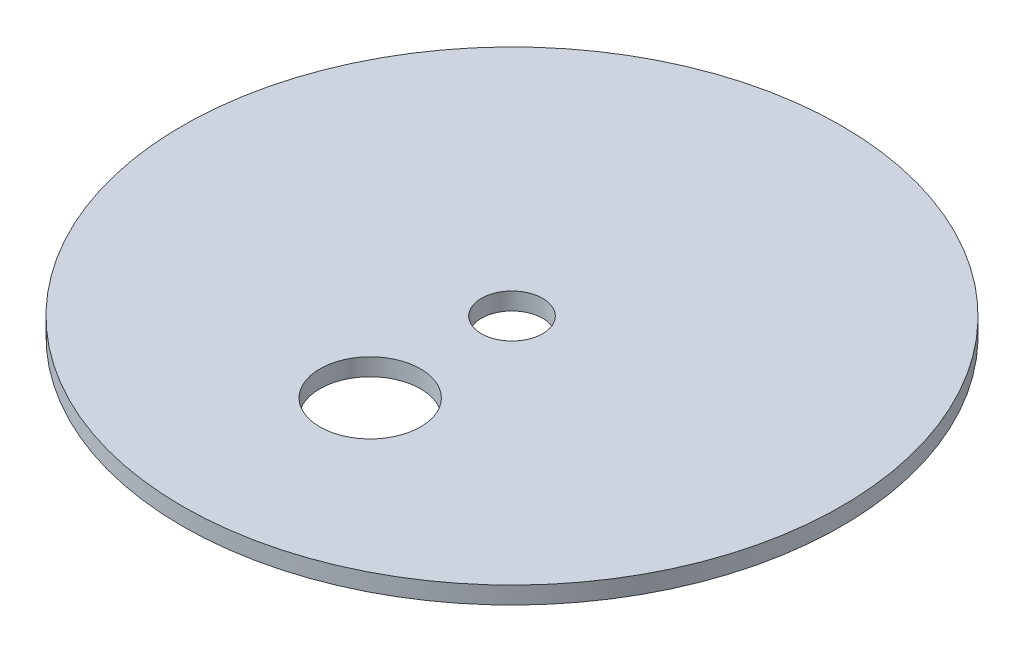
ISO-10303-21;
HEADER;
FILE_DESCRIPTION(('STEP AP214'),'2;1');
FILE_NAME('part.step','',(''),(''),'','','');
FILE_SCHEMA(('AUTOMOTIVE_DESIGN { 1 0 10303 214 1 1 1 1 }'));
ENDSEC;
DATA;
#1=APPLICATION_CONTEXT('core data for automotive mechanical design processes');
#2=APPLICATION_PROTOCOL_DEFINITION('international standard','automotive_design',2000,#1);
#3=PRODUCT_CONTEXT('',#1,'mechanical');
#4=PRODUCT('Part','Part','',(#3));
#5=PRODUCT_RELATED_PRODUCT_CATEGORY('part','',(#4));
#6=PRODUCT_DEFINITION_FORMATION('','',#4);
#7=PRODUCT_DEFINITION_CONTEXT('part definition',#1,'design');
#8=PRODUCT_DEFINITION('design','',#6,#7);
#9=PRODUCT_DEFINITION_SHAPE('','',#8);
#10=(LENGTH_UNIT() NAMED_UNIT(*) SI_UNIT(.MILLI.,.METRE.));
#11=(NAMED_UNIT(*) PLANE_ANGLE_UNIT() SI_UNIT($,.RADIAN.));
#12=(NAMED_UNIT(*) SI_UNIT($,.STERADIAN.) SOLID_ANGLE_UNIT());
#13=UNCERTAINTY_MEASURE_WITH_UNIT(LENGTH_MEASURE(1.E-05),#10,'distance_accuracy_value','');
#14=(GEOMETRIC_REPRESENTATION_CONTEXT(3) GLOBAL_UNCERTAINTY_ASSIGNED_CONTEXT((#13)) GLOBAL_UNIT_ASSIGNED_CONTEXT((#10,
#11,#12)) REPRESENTATION_CONTEXT('',''));
#15=CARTESIAN_POINT('',(0.,0.,0.));
#16=DIRECTION('',(0.,0.,1.));
#17=DIRECTION('',(1.,0.,0.));
#18=AXIS2_PLACEMENT_3D('',#15,#16,#17);
#19=CARTESIAN_POINT('',(0.,3.,0.));
#20=DIRECTION('',(0.,-1.,0.));
#21=DIRECTION('',(0.,0.,-1.));
#22=AXIS2_PLACEMENT_3D('',#19,#20,#21);
#23=CYLINDRICAL_SURFACE('',#22,57.15);
#24=CARTESIAN_POINT('',(0.,3.,0.));
#25=DIRECTION('',(0.,1.,0.));
#26=DIRECTION('',(0.,0.,1.));
#27=AXIS2_PLACEMENT_3D('',#24,#25,#26);
#28=CIRCLE('',#27,57.15);
#29=CARTESIAN_POINT('',(0.,3.,57.15));
#30=VERTEX_POINT('',#29);
#31=EDGE_CURVE('E10',#30,#30,#28,.T.);
#32=ORIENTED_EDGE('',*,*,#31,.F.);
#33=EDGE_LOOP('',(#32));
#34=FACE_BOUND('',#33,.T.);
#35=CARTESIAN_POINT('',(0.,0.,0.));
#36=DIRECTION('',(0.,1.,0.));
#37=DIRECTION('',(0.,0.,1.));
#38=AXIS2_PLACEMENT_3D('',#35,#36,#37);
#39=CIRCLE('',#38,57.15);
#40=CARTESIAN_POINT('',(0.,0.,57.15));
#41=VERTEX_POINT('',#40);
#42=EDGE_CURVE('E40',#41,#41,#39,.T.);
#43=ORIENTED_EDGE('',*,*,#42,.T.);
#44=EDGE_LOOP('',(#43));
#45=FACE_BOUND('',#44,.T.);
#46=ADVANCED_FACE('F33',(#34,#45),#23,.T.);
#47=CARTESIAN_POINT('',(0.,3.,0.));
#48=DIRECTION('',(0.,1.,0.));
#49=DIRECTION('',(0.,0.,1.));
#50=AXIS2_PLACEMENT_3D('',#47,#48,#49);
#51=PLANE('',#50);
#52=CARTESIAN_POINT('',(0.,3.,24.5887982703437));
#53=DIRECTION('',(0.,1.,0.));
#54=DIRECTION('',(0.,0.,1.));
#55=AXIS2_PLACEMENT_3D('',#52,#53,#54);
#56=CIRCLE('',#55,8.72967796818371);
#57=CARTESIAN_POINT('',(0.,3.,33.3184762385274));
#58=VERTEX_POINT('',#57);
#59=EDGE_CURVE('E51',#58,#58,#56,.F.);
#60=ORIENTED_EDGE('',*,*,#59,.T.);
#61=EDGE_LOOP('',(#60));
#62=FACE_BOUND('',#61,.T.);
#63=CARTESIAN_POINT('',(0.,3.,0.));
#64=DIRECTION('',(0.,1.,0.));
#65=DIRECTION('',(0.,0.,1.));
#66=AXIS2_PLACEMENT_3D('',#63,#64,#65);
#67=CIRCLE('',#66,5.31550308643785);
#68=CARTESIAN_POINT('',(0.,3.,5.31550308643785));
#69=VERTEX_POINT('',#68);
#70=EDGE_CURVE('E45',#69,#69,#67,.F.);
#71=ORIENTED_EDGE('',*,*,#70,.T.);
#72=EDGE_LOOP('',(#71));
#73=FACE_BOUND('',#72,.T.);
#74=ORIENTED_EDGE('',*,*,#31,.T.);
#75=EDGE_LOOP('',(#74));
#76=FACE_BOUND('',#75,.T.);
#77=ADVANCED_FACE('F67',(#62,#73,#76),#51,.T.);
#78=CARTESIAN_POINT('',(0.,0.,0.));
#79=DIRECTION('',(0.,1.,0.));
#80=DIRECTION('',(0.,0.,1.));
#81=AXIS2_PLACEMENT_3D('',#78,#79,#80);
#82=PLANE('',#81);
#83=CARTESIAN_POINT('',(0.,0.,24.5887982703437));
#84=DIRECTION('',(0.,1.,0.));
#85=DIRECTION('',(0.,0.,1.));
#86=AXIS2_PLACEMENT_3D('',#83,#84,#85);
#87=CIRCLE('',#86,8.72967796818371);
#88=CARTESIAN_POINT('',(0.,0.,33.3184762385274));
#89=VERTEX_POINT('',#88);
#90=EDGE_CURVE('E36',#89,#89,#87,.F.);
#91=ORIENTED_EDGE('',*,*,#90,.F.);
#92=EDGE_LOOP('',(#91));
#93=FACE_BOUND('',#92,.T.);
#94=CARTESIAN_POINT('',(0.,0.,0.));
#95=DIRECTION('',(0.,1.,0.));
#96=DIRECTION('',(0.,0.,1.));
#97=AXIS2_PLACEMENT_3D('',#94,#95,#96);
#98=CIRCLE('',#97,5.31550308643785);
#99=CARTESIAN_POINT('',(0.,0.,5.31550308643785));
#100=VERTEX_POINT('',#99);
#101=EDGE_CURVE('E49',#100,#100,#98,.F.);
#102=ORIENTED_EDGE('',*,*,#101,.F.);
#103=EDGE_LOOP('',(#102));
#104=FACE_BOUND('',#103,.T.);
#105=ORIENTED_EDGE('',*,*,#42,.F.);
#106=EDGE_LOOP('',(#105));
#107=FACE_BOUND('',#106,.T.);
#108=ADVANCED_FACE('F63',(#93,#104,#107),#82,.F.);
#109=CARTESIAN_POINT('',(0.,13.,0.));
#110=DIRECTION('',(0.,-1.,0.));
#111=DIRECTION('',(0.,0.,-1.));
#112=AXIS2_PLACEMENT_3D('',#109,#110,#111);
#113=CYLINDRICAL_SURFACE('',#112,5.31550308643785);
#114=ORIENTED_EDGE('',*,*,#70,.F.);
#115=EDGE_LOOP('',(#114));
#116=FACE_BOUND('',#115,.T.);
#117=ORIENTED_EDGE('',*,*,#101,.T.);
#118=EDGE_LOOP('',(#117));
#119=FACE_BOUND('',#118,.T.);
#120=ADVANCED_FACE('F66',(#116,#119),#113,.F.);
#121=CARTESIAN_POINT('',(0.,13.,24.5887982703437));
#122=DIRECTION('',(0.,-1.,0.));
#123=DIRECTION('',(0.,0.,-1.));
#124=AXIS2_PLACEMENT_3D('',#121,#122,#123);
#125=CYLINDRICAL_SURFACE('',#124,8.72967796818371);
#126=ORIENTED_EDGE('',*,*,#59,.F.);
#127=EDGE_LOOP('',(#126));
#128=FACE_BOUND('',#127,.T.);
#129=ORIENTED_EDGE('',*,*,#90,.T.);
#130=EDGE_LOOP('',(#129));
#131=FACE_BOUND('',#130,.T.);
#132=ADVANCED_FACE('F61',(#128,#131),#125,.F.);
#133=CLOSED_SHELL('',(#46,#77,#108,#120,#132));
#134=MANIFOLD_SOLID_BREP('B2',#133);
#135=ADVANCED_BREP_SHAPE_REPRESENTATION('',(#18,#134),#14);
#136=SHAPE_DEFINITION_REPRESENTATION(#9,#135);
ENDSEC;
END-ISO-10303-21;
